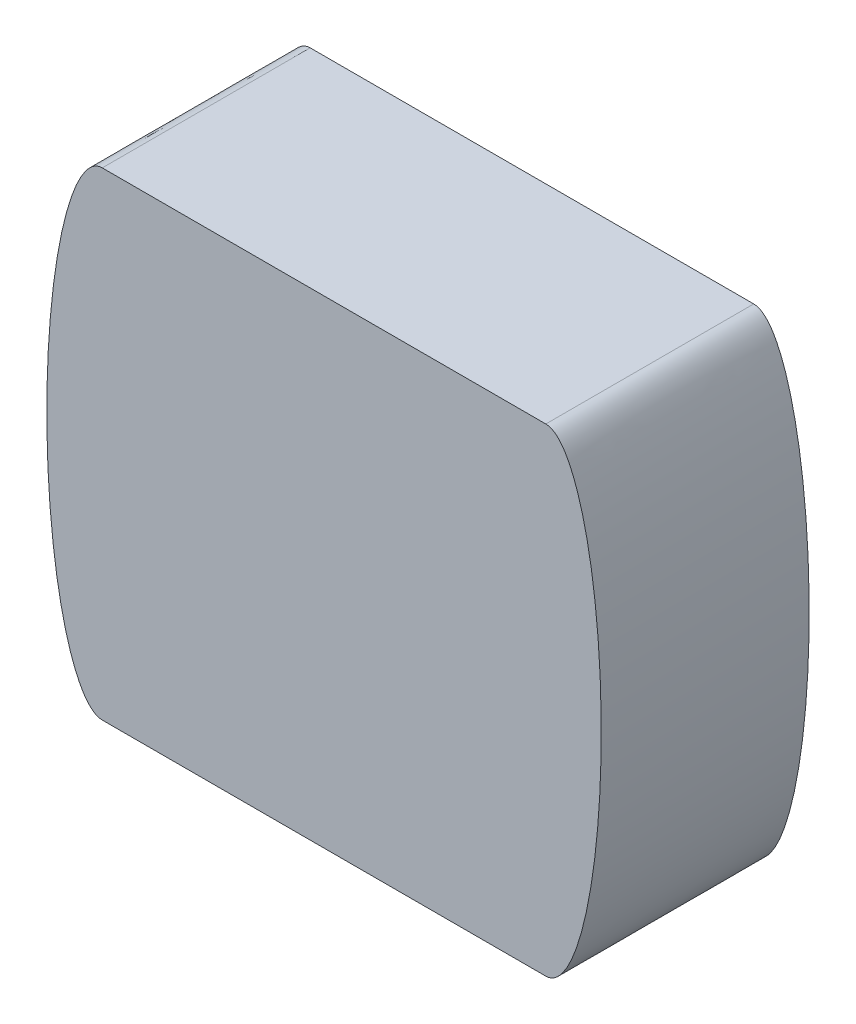
ISO-10303-21;
HEADER;
FILE_DESCRIPTION(('STEP AP214'),'2;1');
FILE_NAME('part.step','',(''),(''),'','','');
FILE_SCHEMA(('AUTOMOTIVE_DESIGN { 1 0 10303 214 1 1 1 1 }'));
ENDSEC;
DATA;
#1=APPLICATION_CONTEXT('core data for automotive mechanical design processes');
#2=APPLICATION_PROTOCOL_DEFINITION('international standard','automotive_design',2000,#1);
#3=PRODUCT_CONTEXT('',#1,'mechanical');
#4=PRODUCT('Part','Part','',(#3));
#5=PRODUCT_RELATED_PRODUCT_CATEGORY('part','',(#4));
#6=PRODUCT_DEFINITION_FORMATION('','',#4);
#7=PRODUCT_DEFINITION_CONTEXT('part definition',#1,'design');
#8=PRODUCT_DEFINITION('design','',#6,#7);
#9=PRODUCT_DEFINITION_SHAPE('','',#8);
#10=(LENGTH_UNIT() NAMED_UNIT(*) SI_UNIT(.MILLI.,.METRE.));
#11=(NAMED_UNIT(*) PLANE_ANGLE_UNIT() SI_UNIT($,.RADIAN.));
#12=(NAMED_UNIT(*) SI_UNIT($,.STERADIAN.) SOLID_ANGLE_UNIT());
#13=UNCERTAINTY_MEASURE_WITH_UNIT(LENGTH_MEASURE(1.E-05),#10,'distance_accuracy_value','');
#14=(GEOMETRIC_REPRESENTATION_CONTEXT(3) GLOBAL_UNCERTAINTY_ASSIGNED_CONTEXT((#13)) GLOBAL_UNIT_ASSIGNED_CONTEXT((#10,
#11,#12)) REPRESENTATION_CONTEXT('',''));
#15=CARTESIAN_POINT('',(0.,0.,0.));
#16=DIRECTION('',(0.,0.,1.));
#17=DIRECTION('',(1.,0.,0.));
#18=AXIS2_PLACEMENT_3D('',#15,#16,#17);
#19=CARTESIAN_POINT('',(32.264392252,-27.384502,-23.8125));
#20=DIRECTION('',(0.,0.,-1.));
#21=DIRECTION('',(-1.,0.,0.));
#22=AXIS2_PLACEMENT_3D('',#19,#20,#21);
#23=PLANE('',#22);
#24=CARTESIAN_POINT('',(-25.3999999998034,-27.384502,-23.8125));
#25=CARTESIAN_POINT('',(-25.4474108565116,-27.3845282154363,-23.8125));
#26=CARTESIAN_POINT('',(-25.4948060506385,-27.3822130377337,-23.8125));
#27=CARTESIAN_POINT('',(-25.5890954650979,-27.3731046407743,-23.8125));
#28=CARTESIAN_POINT('',(-25.63599032603,-27.3663180910956,-23.8125));
#29=CARTESIAN_POINT('',(-25.7283047487232,-27.3485950252414,-23.8125));
#30=CARTESIAN_POINT('',(-25.7737357641708,-27.3377176989436,-23.8125));
#31=CARTESIAN_POINT('',(-25.8635125307443,-27.3121405410807,-23.8125));
#32=CARTESIAN_POINT('',(-25.90785782415,-27.2974391267096,-23.8125));
#33=CARTESIAN_POINT('',(-26.0632647698725,-27.2389929897544,-23.8125));
#34=CARTESIAN_POINT('',(-26.1707857786966,-27.1856475608229,-23.8125));
#35=CARTESIAN_POINT('',(-26.3764297183469,-27.0625697469429,-23.8125));
#36=CARTESIAN_POINT('',(-26.4744896389666,-26.992736921706,-23.8125));
#37=CARTESIAN_POINT('',(-26.6514713994855,-26.849902178393,-23.8125));
#38=CARTESIAN_POINT('',(-26.731319590472,-26.7780260152477,-23.8125));
#39=CARTESIAN_POINT('',(-26.8846235541003,-26.6277007435115,-23.8125));
#40=CARTESIAN_POINT('',(-26.958073702732,-26.54924596872,-23.8125));
#41=CARTESIAN_POINT('',(-27.0994935448194,-26.3873991321746,-23.8125));
#42=CARTESIAN_POINT('',(-27.1674555546332,-26.3040004223779,-23.8125));
#43=CARTESIAN_POINT('',(-27.2985410165497,-26.133559644683,-23.8125));
#44=CARTESIAN_POINT('',(-27.3616662641783,-26.0465189475147,-23.8125));
#45=CARTESIAN_POINT('',(-27.4870927852584,-25.8647520149633,-23.8125));
#46=CARTESIAN_POINT('',(-27.5491607791176,-25.7698656560019,-23.8125));
#47=CARTESIAN_POINT('',(-27.6693071962326,-25.5775880892073,-23.8125));
#48=CARTESIAN_POINT('',(-27.7273848481928,-25.4801964020898,-23.8125));
#49=CARTESIAN_POINT('',(-27.8401408339113,-25.2832564881225,-23.8125));
#50=CARTESIAN_POINT('',(-27.8948133413012,-25.1837049378215,-23.8125));
#51=CARTESIAN_POINT('',(-28.0010713260364,-24.9829635598123,-23.8125));
#52=CARTESIAN_POINT('',(-28.0526565186571,-24.8817735820917,-23.8125));
#53=CARTESIAN_POINT('',(-28.2033876113732,-24.5760265779394,-23.8125));
#54=CARTESIAN_POINT('',(-28.2984260742924,-24.3694401971516,-23.8125));
#55=CARTESIAN_POINT('',(-28.480150254555,-23.9513072489447,-23.8125));
#56=CARTESIAN_POINT('',(-28.5667864795313,-23.7397394572367,-23.8125));
#57=CARTESIAN_POINT('',(-28.7325214830838,-23.3139834671105,-23.8125));
#58=CARTESIAN_POINT('',(-28.8116293743646,-23.0997988001774,-23.8125));
#59=CARTESIAN_POINT('',(-28.9635100293903,-22.6693134899555,-23.8125));
#60=CARTESIAN_POINT('',(-29.0362855167217,-22.4530138013187,-23.8125));
#61=CARTESIAN_POINT('',(-29.2135602433995,-21.903495852857,-23.8125));
#62=CARTESIAN_POINT('',(-29.3144169477515,-21.5691027065562,-23.8125));
#63=CARTESIAN_POINT('',(-29.5056733048012,-20.8973203985929,-23.8125));
#64=CARTESIAN_POINT('',(-29.5960714833666,-20.5599308217816,-23.8125));
#65=CARTESIAN_POINT('',(-29.7681048542818,-19.8824218059908,-23.8125));
#66=CARTESIAN_POINT('',(-29.8497273384998,-19.5422991547614,-23.8125));
#67=CARTESIAN_POINT('',(-30.0052507891167,-18.860290969483,-23.8125));
#68=CARTESIAN_POINT('',(-30.0791515076659,-18.5184053792174,-23.8125));
#69=CARTESIAN_POINT('',(-30.2202422699195,-17.8327151273564,-23.8125));
#70=CARTESIAN_POINT('',(-30.2874219375101,-17.4889083380121,-23.8125));
#71=CARTESIAN_POINT('',(-30.4156481736004,-16.8001555092042,-23.8125));
#72=CARTESIAN_POINT('',(-30.4766946760562,-16.4552094575138,-23.8125));
#73=CARTESIAN_POINT('',(-30.6515381752158,-15.4188111525561,-23.8125));
#74=CARTESIAN_POINT('',(-30.7570094471066,-14.7259459146217,-23.8125));
#75=CARTESIAN_POINT('',(-30.9491325987724,-13.3372840586145,-23.8125));
#76=CARTESIAN_POINT('',(-31.0357745752794,-12.6414860932349,-23.8125));
#77=CARTESIAN_POINT('',(-31.1923036707721,-11.248873491501,-23.8125));
#78=CARTESIAN_POINT('',(-31.2622109905159,-10.5520611128959,-23.8125));
#79=CARTESIAN_POINT('',(-31.3869337890691,-9.15750845502789,-23.8125));
#80=CARTESIAN_POINT('',(-31.4417580796198,-8.45976895785936,-23.8125));
#81=CARTESIAN_POINT('',(-31.5374525109823,-7.06340385554987,-23.8125));
#82=CARTESIAN_POINT('',(-31.5783238794439,-6.36477833379759,-23.8125));
#83=CARTESIAN_POINT('',(-31.6572886061565,-4.75457487741733,-23.8125));
#84=CARTESIAN_POINT('',(-31.6907674527856,-3.84276862746389,-23.8125));
#85=CARTESIAN_POINT('',(-31.7363018821774,-2.01832525496199,-23.8125));
#86=CARTESIAN_POINT('',(-31.7483502577537,-1.10568795612687,-23.8125));
#87=CARTESIAN_POINT('',(-31.7513344655972,0.719773327715059,-23.8125));
#88=CARTESIAN_POINT('',(-31.7422667986893,1.63259731859524,-23.8125));
#89=CARTESIAN_POINT('',(-31.7028037754042,3.45579318893192,-23.8125));
#90=CARTESIAN_POINT('',(-31.6724550774834,4.36616606720557,-23.8125));
#91=CARTESIAN_POINT('',(-31.5896117532939,6.18576080190364,-23.8125));
#92=CARTESIAN_POINT('',(-31.53712072741,7.09498282136315,-23.8125));
#93=CARTESIAN_POINT('',(-31.4083960459064,8.91162651837242,-23.8125));
#94=CARTESIAN_POINT('',(-31.3321663913154,9.81904847339608,-23.8125));
#95=CARTESIAN_POINT('',(-31.1959848430883,11.198654244039,-23.8125));
#96=CARTESIAN_POINT('',(-31.1456370801741,11.6717974995867,-23.8125));
#97=CARTESIAN_POINT('',(-31.0371687026176,12.6171989582657,-23.8125));
#98=CARTESIAN_POINT('',(-30.979048087436,13.0894571613356,-23.8125));
#99=CARTESIAN_POINT('',(-30.8543475994743,14.0328926425202,-23.8125));
#100=CARTESIAN_POINT('',(-30.787767124404,14.50406984124,-23.8125));
#101=CARTESIAN_POINT('',(-30.645266026145,15.4450095374526,-23.8125));
#102=CARTESIAN_POINT('',(-30.5693456182989,15.9147720673064,-23.8125));
#103=CARTESIAN_POINT('',(-30.4322086966101,16.7068340577818,-23.8125));
#104=CARTESIAN_POINT('',(-30.3737503971552,17.0296118982115,-23.8125));
#105=CARTESIAN_POINT('',(-30.2513439773555,17.6741238830893,-23.8125));
#106=CARTESIAN_POINT('',(-30.187395949641,17.9958580450527,-23.8125));
#107=CARTESIAN_POINT('',(-30.0533936732265,18.6381023953159,-23.8125));
#108=CARTESIAN_POINT('',(-29.9833385768171,18.958612407228,-23.8125));
#109=CARTESIAN_POINT('',(-29.8363647036672,19.5980544883913,-23.8125));
#110=CARTESIAN_POINT('',(-29.7594461387023,19.9169866060088,-23.8125));
#111=CARTESIAN_POINT('',(-29.622510781505,20.4554671980027,-23.8125));
#112=CARTESIAN_POINT('',(-29.5645334720965,20.6755347067088,-23.8125));
#113=CARTESIAN_POINT('',(-29.4443710344864,21.1145168099118,-23.8125));
#114=CARTESIAN_POINT('',(-29.382186004677,21.3334314312385,-23.8125));
#115=CARTESIAN_POINT('',(-29.2531347249479,21.7697149703282,-23.8125));
#116=CARTESIAN_POINT('',(-29.1862717537126,21.9870848553635,-23.8125));
#117=CARTESIAN_POINT('',(-29.0471806638315,22.4201012534879,-23.8125));
#118=CARTESIAN_POINT('',(-28.9749527732686,22.6357478394095,-23.8125));
#119=CARTESIAN_POINT('',(-28.8469299095056,23.0003944072859,-23.8125));
#120=CARTESIAN_POINT('',(-28.7927183200583,23.1499504361167,-23.8125));
#121=CARTESIAN_POINT('',(-28.6808996097129,23.4477857946162,-23.8125));
#122=CARTESIAN_POINT('',(-28.6232926145587,23.596065171331,-23.8125));
#123=CARTESIAN_POINT('',(-28.5041263366593,23.8913735825436,-23.8125));
#124=CARTESIAN_POINT('',(-28.4425594627229,24.0383995642403,-23.8125));
#125=CARTESIAN_POINT('',(-28.3150302320352,24.3305304280477,-23.8125));
#126=CARTESIAN_POINT('',(-28.2490681179383,24.4756354156842,-23.8125));
#127=CARTESIAN_POINT('',(-28.1073801736147,24.7732505171101,-23.8125));
#128=CARTESIAN_POINT('',(-28.0312952634311,24.9255907401118,-23.8125));
#129=CARTESIAN_POINT('',(-27.8721897512499,25.2267067925547,-23.8125));
#130=CARTESIAN_POINT('',(-27.7891666180919,25.3754812954774,-23.8125));
#131=CARTESIAN_POINT('',(-27.615035558581,25.6675830968479,-23.8125));
#132=CARTESIAN_POINT('',(-27.523955823124,25.8109270639183,-23.8125));
#133=CARTESIAN_POINT('',(-27.3315687163003,26.0905191081527,-23.8125));
#134=CARTESIAN_POINT('',(-27.2302710543238,26.2267737385979,-23.8125));
#135=CARTESIAN_POINT('',(-27.0364099826374,26.4623799656259,-23.8125));
#136=CARTESIAN_POINT('',(-26.9461864123879,26.5636426293056,-23.8125));
#137=CARTESIAN_POINT('',(-26.7554075660336,26.7567481813992,-23.8125));
#138=CARTESIAN_POINT('',(-26.6548263948228,26.8485662540644,-23.8125));
#139=CARTESIAN_POINT('',(-26.4941903954283,26.9759296140806,-23.8125));
#140=CARTESIAN_POINT('',(-26.4384870445415,27.0169682555927,-23.8125));
#141=CARTESIAN_POINT('',(-26.3238262983183,27.0943025663326,-23.8125));
#142=CARTESIAN_POINT('',(-26.2648681834248,27.1305971807389,-23.8125));
#143=CARTESIAN_POINT('',(-26.1441126556514,27.1970880726625,-23.8125));
#144=CARTESIAN_POINT('',(-26.0823381371202,27.2273254587272,-23.8125));
#145=CARTESIAN_POINT('',(-25.9558581984847,27.2807556575759,-23.8125));
#146=CARTESIAN_POINT('',(-25.891155883347,27.3039557412197,-23.8125));
#147=CARTESIAN_POINT('',(-25.756536559696,27.3429091687682,-23.8125));
#148=CARTESIAN_POINT('',(-25.6865146275223,27.358310700453,-23.8125));
#149=CARTESIAN_POINT('',(-25.5800873672771,27.3739225437953,-23.8125));
#150=CARTESIAN_POINT('',(-25.5442035148857,27.377878741608,-23.8125));
#151=CARTESIAN_POINT('',(-25.4722177793299,27.3831722970032,-23.8125));
#152=CARTESIAN_POINT('',(-25.4361157579886,27.3845077701716,-23.8125));
#153=CARTESIAN_POINT('',(-25.4000000007193,27.384502,-23.8125));
#154=B_SPLINE_CURVE_WITH_KNOTS('',3,(#24,#25,#26,#27,#28,#29,#30,#31,#32,#33,#34,#35,#36,#37,
#38,#39,#40,#41,#42,#43,#44,#45,#46,#47,#48,#49,#50,#51,#52,#53,#54,#55,#56,#57,#58,#59,#60,#61,
#62,#63,#64,#65,#66,#67,#68,#69,#70,#71,#72,#73,#74,#75,#76,#77,#78,#79,#80,#81,#82,#83,#84,#85,
#86,#87,#88,#89,#90,#91,#92,#93,#94,#95,#96,#97,#98,#99,#100,#101,#102,#103,#104,#105,#106,#107,
#108,#109,#110,#111,#112,#113,#114,#115,#116,#117,#118,#119,#120,#121,#122,#123,#124,#125,#126,
#127,#128,#129,#130,#131,#132,#133,#134,#135,#136,#137,#138,#139,#140,#141,#142,#143,#144,#145,
#146,#147,#148,#149,#150,#151,#152,#153),.UNSPECIFIED.,.F.,.F.,(4,2,2,2,2,2,2,2,2,2,2,2,2,2,2,2,
2,2,2,2,2,2,2,2,2,2,2,2,2,2,2,2,2,2,2,2,2,2,2,2,2,2,2,2,2,2,2,2,2,2,2,2,2,2,2,2,2,2,2,2,2,2,2,2,
4),(0.,0.142150840148898,0.284090124156124,0.424050102074764,0.564068102447389,
0.921925257352111,1.28202142386815,1.60384354387866,1.92594575600812,2.24849137728689,
2.57091667563069,2.91095074569661,3.25105035732693,3.59171675538916,3.93241452281851,
4.61431756957029,5.30002019401909,5.984881958311,6.6694476902224,7.71703647860022,
8.76477274549915,9.81400637010674,10.8632736621961,11.9141366193606,12.9650108913293,
15.0672096157166,17.1705113299753,19.2712611546976,21.3707810697089,23.4701162105441,
26.2071040607239,28.9450122012183,31.6833740773829,34.4157508176512,37.147683439389,
39.8791558563502,41.3065471960198,42.733938634716,44.1614317519346,45.5888919628844,
46.5729380475207,47.5569675312397,48.5411338241977,49.5252697607052,50.207964212044,
50.8906427049485,51.5728474236995,52.2550231559485,52.7322233186607,53.2094058200393,
53.6875320542297,54.1656319136472,54.6763382710402,55.187231761424,55.6964034073216,
56.2050957006323,56.6114947803578,57.0189357746915,57.2263113325813,57.433732921713,
57.6396951881414,57.8454439261606,58.0597930136998,58.1680118699525,58.2763085117668),.UNSPECIFIED.);
#155=CARTESIAN_POINT('',(-25.4000000004151,-27.384502,-23.8125));
#156=VERTEX_POINT('',#155);
#157=CARTESIAN_POINT('',(-25.4000000023452,27.384502,-23.8125));
#158=VERTEX_POINT('',#157);
#159=EDGE_CURVE('E81',#156,#158,#154,.T.);
#160=ORIENTED_EDGE('',*,*,#159,.T.);
#161=DIRECTION('',(-1.,0.,0.));
#162=VECTOR('',#161,1.);
#163=CARTESIAN_POINT('',(0.,27.384502,-23.8125));
#164=LINE('',#163,#162);
#165=CARTESIAN_POINT('',(25.3999999988274,27.384502,-23.8125));
#166=VERTEX_POINT('',#165);
#167=EDGE_CURVE('E62',#166,#158,#164,.T.);
#168=ORIENTED_EDGE('',*,*,#167,.F.);
#169=CARTESIAN_POINT('',(25.3999999983741,27.384502,-23.8125));
#170=CARTESIAN_POINT('',(25.4474108551471,27.3845282154825,-23.8125));
#171=CARTESIAN_POINT('',(25.4948060493412,27.3822130378194,-23.8125));
#172=CARTESIAN_POINT('',(25.5890954639371,27.3731046409255,-23.8125));
#173=CARTESIAN_POINT('',(25.6359903249385,27.3663180912728,-23.8125));
#174=CARTESIAN_POINT('',(25.7283047477676,27.3485950254568,-23.8125));
#175=CARTESIAN_POINT('',(25.7737357632818,27.3377176991717,-23.8125));
#176=CARTESIAN_POINT('',(25.8635125299872,27.3121405413217,-23.8125));
#177=CARTESIAN_POINT('',(25.9078578234583,27.2974391269509,-23.8125));
#178=CARTESIAN_POINT('',(26.0632647692406,27.2389929900402,-23.8125));
#179=CARTESIAN_POINT('',(26.1707857780645,27.1856475611562,-23.8125));
#180=CARTESIAN_POINT('',(26.376429717718,27.0625697473649,-23.8125));
#181=CARTESIAN_POINT('',(26.4744896383412,26.9927369221692,-23.8125));
#182=CARTESIAN_POINT('',(26.6514713988254,26.8499021789628,-23.8125));
#183=CARTESIAN_POINT('',(26.7313195897775,26.7780260158879,-23.8125));
#184=CARTESIAN_POINT('',(26.8846235533428,26.6277007442951,-23.8125));
#185=CARTESIAN_POINT('',(26.9580737019459,26.5492459695763,-23.8125));
#186=CARTESIAN_POINT('',(27.0994935439804,26.387399133178,-23.8125));
#187=CARTESIAN_POINT('',(27.1674555537698,26.3040004234556,-23.8125));
#188=CARTESIAN_POINT('',(27.298541015641,26.1335596459096,-23.8125));
#189=CARTESIAN_POINT('',(27.3616662632485,26.046518948816,-23.8125));
#190=CARTESIAN_POINT('',(27.4870927842682,25.8647520164471,-23.8125));
#191=CARTESIAN_POINT('',(27.5491607780896,25.7698656575944,-23.8125));
#192=CARTESIAN_POINT('',(27.6693071951336,25.5775880910189,-23.8125));
#193=CARTESIAN_POINT('',(27.7273848470604,25.4801964040116,-23.8125));
#194=CARTESIAN_POINT('',(27.8401408327161,25.2832564902661,-23.8125));
#195=CARTESIAN_POINT('',(27.8948133400763,25.1837049400766,-23.8125));
#196=CARTESIAN_POINT('',(28.0010713247555,24.982963562291,-23.8125));
#197=CARTESIAN_POINT('',(28.0526565173497,24.8817735846825,-23.8125));
#198=CARTESIAN_POINT('',(28.2033876099902,24.5760265808677,-23.8125));
#199=CARTESIAN_POINT('',(28.2984260728642,24.3694402003059,-23.8125));
#200=CARTESIAN_POINT('',(28.4801502530442,23.9513072525531,-23.8125));
#201=CARTESIAN_POINT('',(28.5667864779832,23.7397394610733,-23.8125));
#202=CARTESIAN_POINT('',(28.7325214814673,23.3139834714035,-23.8125));
#203=CARTESIAN_POINT('',(28.8116293727171,23.0997988046987,-23.8125));
#204=CARTESIAN_POINT('',(28.9635100276861,22.6693134949337,-23.8125));
#205=CARTESIAN_POINT('',(29.0362855149918,22.4530138065255,-23.8125));
#206=CARTESIAN_POINT('',(29.2135602415892,21.9034958587073,-23.8125));
#207=CARTESIAN_POINT('',(29.3144169458919,21.5691027128224,-23.8125));
#208=CARTESIAN_POINT('',(29.5056733028554,20.8973204056922,-23.8125));
#209=CARTESIAN_POINT('',(29.5960714813839,20.559930829298,-23.8125));
#210=CARTESIAN_POINT('',(29.7681048522354,19.8824218143426,-23.8125));
#211=CARTESIAN_POINT('',(29.8497273364266,19.5422991635316,-23.8125));
#212=CARTESIAN_POINT('',(30.005250786999,18.8602909790904,-23.8125));
#213=CARTESIAN_POINT('',(30.0791515055305,18.5184053892436,-23.8125));
#214=CARTESIAN_POINT('',(30.2202422677564,17.8327151382209,-23.8125));
#215=CARTESIAN_POINT('',(30.2874219353373,17.4889083492963,-23.8125));
#216=CARTESIAN_POINT('',(30.4156481714153,16.8001555213276,-23.8125));
#217=CARTESIAN_POINT('',(30.4766946738687,16.4552094700569,-23.8125));
#218=CARTESIAN_POINT('',(30.6515381730309,15.4188111663584,-23.8125));
#219=CARTESIAN_POINT('',(30.7570094449371,14.7259459292635,-23.8125));
#220=CARTESIAN_POINT('',(30.9491325966583,13.3372840749336,-23.8125));
#221=CARTESIAN_POINT('',(31.0357745732052,12.6414861103917,-23.8125));
#222=CARTESIAN_POINT('',(31.1923036688011,11.2488735103313,-23.8125));
#223=CARTESIAN_POINT('',(31.2622109886079,10.5520611325621,-23.8125));
#224=CARTESIAN_POINT('',(31.3869337873098,9.15750847636415,-23.8125));
#225=CARTESIAN_POINT('',(31.4417580779461,8.4597689800298,-23.8125));
#226=CARTESIAN_POINT('',(31.5374525095029,7.06340387938712,-23.8125));
#227=CARTESIAN_POINT('',(31.578323878073,6.36477835846748,-23.8125));
#228=CARTESIAN_POINT('',(31.6572886051482,4.75457490226504,-23.8125));
#229=CARTESIAN_POINT('',(31.6907674519969,3.84276865165398,-23.8125));
#230=CARTESIAN_POINT('',(31.7363018817916,2.01832527783092,-23.8125));
#231=CARTESIAN_POINT('',(31.748350257551,1.10568797833225,-23.8125));
#232=CARTESIAN_POINT('',(31.7513344657296,-0.719773306840948,-23.8125));
#233=CARTESIAN_POINT('',(31.7422667989738,-1.63259729838885,-23.8125));
#234=CARTESIAN_POINT('',(31.7028037759653,-3.45579317006146,-23.8125));
#235=CARTESIAN_POINT('',(31.6724550781692,-4.36616604900331,-23.8125));
#236=CARTESIAN_POINT('',(31.5896117542046,-6.18576078503978,-23.8125));
#237=CARTESIAN_POINT('',(31.537120728421,-7.09498280516951,-23.8125));
#238=CARTESIAN_POINT('',(31.4083960470953,-8.911626503521,-23.8125));
#239=CARTESIAN_POINT('',(31.3321663925819,-9.81904845921668,-23.8125));
#240=CARTESIAN_POINT('',(31.1959848444576,-11.1986542308707,-23.8125));
#241=CARTESIAN_POINT('',(31.1456370815767,-11.6717974867568,-23.8125));
#242=CARTESIAN_POINT('',(31.0371687040814,-12.6171989461132,-23.8125));
#243=CARTESIAN_POINT('',(30.9790480889276,-13.0894571495221,-23.8125));
#244=CARTESIAN_POINT('',(30.854347601016,-14.0328926313851,-23.8125));
#245=CARTESIAN_POINT('',(30.787767125968,-14.5040698304445,-23.8125));
#246=CARTESIAN_POINT('',(30.645266027748,-15.4450095273367,-23.8125));
#247=CARTESIAN_POINT('',(30.5693456199186,-15.9147720575306,-23.8125));
#248=CARTESIAN_POINT('',(30.4322086982542,-16.7068340485758,-23.8125));
#249=CARTESIAN_POINT('',(30.3737503988085,-17.029611889235,-23.8125));
#250=CARTESIAN_POINT('',(30.2513439790247,-17.6741238745723,-23.8125));
#251=CARTESIAN_POINT('',(30.1873959513167,-17.9958580367657,-23.8125));
#252=CARTESIAN_POINT('',(30.0533936749129,-18.6381023874891,-23.8125));
#253=CARTESIAN_POINT('',(29.9833385785075,-18.9586123996316,-23.8125));
#254=CARTESIAN_POINT('',(29.8363647053628,-19.598054481256,-23.8125));
#255=CARTESIAN_POINT('',(29.7594461403994,-19.9169865991044,-23.8125));
#256=CARTESIAN_POINT('',(29.6225107832023,-20.4554671914886,-23.8125));
#257=CARTESIAN_POINT('',(29.5645334737934,-20.6755347003539,-23.8125));
#258=CARTESIAN_POINT('',(29.4443710361813,-21.1145168038757,-23.8125));
#259=CARTESIAN_POINT('',(29.3821860063702,-21.3334314253621,-23.8125));
#260=CARTESIAN_POINT('',(29.2531347266364,-21.7697149647718,-23.8125));
#261=CARTESIAN_POINT('',(29.186271755398,-21.9870848499676,-23.8125));
#262=CARTESIAN_POINT('',(29.0471806655094,-22.4201012484134,-23.8125));
#263=CARTESIAN_POINT('',(28.974952774942,-22.6357478344962,-23.8125));
#264=CARTESIAN_POINT('',(28.8469299111701,-23.0003944026475,-23.8125));
#265=CARTESIAN_POINT('',(28.7927183217188,-23.1499504315919,-23.8125));
#266=CARTESIAN_POINT('',(28.6808996113646,-23.4477857903191,-23.8125));
#267=CARTESIAN_POINT('',(28.6232926162055,-23.5960651671482,-23.8125));
#268=CARTESIAN_POINT('',(28.504126338296,-23.8913735785896,-23.8125));
#269=CARTESIAN_POINT('',(28.4425594643543,-24.038399560401,-23.8125));
#270=CARTESIAN_POINT('',(28.3150302336553,-24.3305304244387,-23.8125));
#271=CARTESIAN_POINT('',(28.2490681195524,-24.4756354121908,-23.8125));
#272=CARTESIAN_POINT('',(28.1073801752287,-24.7732505138298,-23.8125));
#273=CARTESIAN_POINT('',(28.0312952650521,-24.9255907369295,-23.8125));
#274=CARTESIAN_POINT('',(27.8721897528865,-25.226706789572,-23.8125));
#275=CARTESIAN_POINT('',(27.7891666197373,-25.3754812925963,-23.8125));
#276=CARTESIAN_POINT('',(27.615035560246,-25.6675830941757,-23.8125));
#277=CARTESIAN_POINT('',(27.5239558247999,-25.8109270613534,-23.8125));
#278=CARTESIAN_POINT('',(27.3315687180009,-26.0905191058111,-23.8125));
#279=CARTESIAN_POINT('',(27.2302710560381,-26.2267737363722,-23.8125));
#280=CARTESIAN_POINT('',(27.0364099843548,-26.4623799636521,-23.8125));
#281=CARTESIAN_POINT('',(26.9461864140915,-26.5636426274629,-23.8125));
#282=CARTESIAN_POINT('',(26.755407567704,-26.7567481798272,-23.8125));
#283=CARTESIAN_POINT('',(26.6548263964737,-26.8485662526318,-23.8125));
#284=CARTESIAN_POINT('',(26.4941903970417,-26.975929612864,-23.8125));
#285=CARTESIAN_POINT('',(26.4384870461412,-27.0169682544498,-23.8125));
#286=CARTESIAN_POINT('',(26.3238262998864,-27.094302565339,-23.8125));
#287=CARTESIAN_POINT('',(26.264868184975,-27.1305971798208,-23.8125));
#288=CARTESIAN_POINT('',(26.1441126571613,-27.1970880718951,-23.8125));
#289=CARTESIAN_POINT('',(26.0823381386076,-27.2273254580352,-23.8125));
#290=CARTESIAN_POINT('',(25.9558581999199,-27.2807556570333,-23.8125));
#291=CARTESIAN_POINT('',(25.8911558847522,-27.3039557407514,-23.8124999999999));
#292=CARTESIAN_POINT('',(25.7565365606685,-27.3429091685509,-23.8125000000001));
#293=CARTESIAN_POINT('',(25.6865146280774,-27.3583107003653,-23.8125000000003));
#294=CARTESIAN_POINT('',(25.5800873671867,-27.3739225438117,-23.8124999999999));
#295=CARTESIAN_POINT('',(25.5442035145735,-27.3778787416439,-23.8124999999996));
#296=CARTESIAN_POINT('',(25.4722177785724,-27.3831722970459,-23.8125000000004));
#297=CARTESIAN_POINT('',(25.4361157570073,-27.3845077702013,-23.8125000000014));
#298=CARTESIAN_POINT('',(25.3999999995153,-27.384502,-23.8125000000037));
#299=B_SPLINE_CURVE_WITH_KNOTS('',3,(#169,#170,#171,#172,#173,#174,#175,#176,#177,#178,#179,
#180,#181,#182,#183,#184,#185,#186,#187,#188,#189,#190,#191,#192,#193,#194,#195,#196,#197,#198,
#199,#200,#201,#202,#203,#204,#205,#206,#207,#208,#209,#210,#211,#212,#213,#214,#215,#216,#217,
#218,#219,#220,#221,#222,#223,#224,#225,#226,#227,#228,#229,#230,#231,#232,#233,#234,#235,#236,
#237,#238,#239,#240,#241,#242,#243,#244,#245,#246,#247,#248,#249,#250,#251,#252,#253,#254,#255,
#256,#257,#258,#259,#260,#261,#262,#263,#264,#265,#266,#267,#268,#269,#270,#271,#272,#273,#274,
#275,#276,#277,#278,#279,#280,#281,#282,#283,#284,#285,#286,#287,#288,#289,#290,#291,#292,#293,
#294,#295,#296,#297,#298),.UNSPECIFIED.,.F.,.F.,(4,2,2,2,2,2,2,2,2,2,2,2,2,2,2,2,2,2,2,2,2,2,2,
2,2,2,2,2,2,2,2,2,2,2,2,2,2,2,2,2,2,2,2,2,2,2,2,2,2,2,2,2,2,2,2,2,2,2,2,2,2,2,2,2,4),(0.,
0.142150840343272,0.284090124544131,0.424050102647561,0.56406810320504,0.921925258045287,
1.28202142449715,1.60384354429005,1.92594575620147,2.24849137726156,2.5709166753869,
2.91095074511779,3.25105035641297,3.59171675413937,3.93241452123286,4.61431756731227,
5.30002019108531,5.98488195470249,6.66944768593954,7.71703647308032,8.76477273874202,
9.81400636211048,10.8632736529607,11.9141366088842,12.9650108796119,15.0672096015166,
17.1705113132966,19.2712611355431,21.3707810480799,23.4701161864408,26.2071040386153,
28.9450121811069,31.6833740592695,34.4157508015284,37.1476834252558,39.8791558442062,
41.3065471848748,42.7339386245701,44.1614317427878,45.5888919547367,46.5729380400457,
47.5569675244374,48.5411338180678,49.5252697552477,50.2079642070487,50.8906427004153,
51.5728474196289,52.2550231523405,52.7322233153772,53.2094058170804,53.6875320515942,
54.1656319113352,54.6763382689821,55.1872317596195,55.6964034057718,56.2050956993383,
56.6114947793857,57.0189357740455,57.2263113321,57.4337329213962,57.6396951879841,
57.8454439261633,58.0597930149955,58.1680118719142,58.276308514396),.UNSPECIFIED.);
#300=CARTESIAN_POINT('',(25.3999999997734,-27.384502,-23.8125));
#301=VERTEX_POINT('',#300);
#302=EDGE_CURVE('E22',#166,#301,#299,.T.);
#303=ORIENTED_EDGE('',*,*,#302,.T.);
#304=DIRECTION('',(1.,0.,0.));
#305=VECTOR('',#304,1.);
#306=CARTESIAN_POINT('',(0.,-27.384502,-23.8125));
#307=LINE('',#306,#305);
#308=EDGE_CURVE('E66',#156,#301,#307,.T.);
#309=ORIENTED_EDGE('',*,*,#308,.F.);
#310=EDGE_LOOP('',(#160,#168,#303,#309));
#311=FACE_BOUND('',#310,.T.);
#312=ADVANCED_FACE('F17',(#311),#23,.T.);
#313=CARTESIAN_POINT('',(-25.4,27.384502,-23.8125));
#314=DIRECTION('',(0.,1.,0.));
#315=DIRECTION('',(0.,0.,1.));
#316=AXIS2_PLACEMENT_3D('',#313,#314,#315);
#317=PLANE('',#316);
#318=DIRECTION('',(1.,0.,0.));
#319=VECTOR('',#318,1.);
#320=CARTESIAN_POINT('',(0.,27.384502,0.));
#321=LINE('',#320,#319);
#322=CARTESIAN_POINT('',(-25.400000000266,27.384502,0.));
#323=VERTEX_POINT('',#322);
#324=CARTESIAN_POINT('',(25.3999999977878,27.384502,0.));
#325=VERTEX_POINT('',#324);
#326=EDGE_CURVE('E130',#323,#325,#321,.T.);
#327=ORIENTED_EDGE('',*,*,#326,.T.);
#328=DIRECTION('',(0.,0.,-1.));
#329=VECTOR('',#328,1.);
#330=CARTESIAN_POINT('',(25.3999999976548,27.384502,-11.90625));
#331=LINE('',#330,#329);
#332=EDGE_CURVE('E75',#325,#166,#331,.T.);
#333=ORIENTED_EDGE('',*,*,#332,.T.);
#334=ORIENTED_EDGE('',*,*,#167,.T.);
#335=DIRECTION('',(0.,0.,1.));
#336=VECTOR('',#335,1.);
#337=CARTESIAN_POINT('',(-25.4000000023452,27.384502,-11.90625));
#338=LINE('',#337,#336);
#339=EDGE_CURVE('E111',#158,#323,#338,.T.);
#340=ORIENTED_EDGE('',*,*,#339,.T.);
#341=EDGE_LOOP('',(#327,#333,#334,#340));
#342=FACE_BOUND('',#341,.T.);
#343=ADVANCED_FACE('F115',(#342),#317,.T.);
#344=CARTESIAN_POINT('',(25.4,-27.384502,0.));
#345=CARTESIAN_POINT('',(25.4,-27.384502,-23.8125));
#346=CARTESIAN_POINT('',(29.119743879,-27.384502,0.));
#347=CARTESIAN_POINT('',(29.119743879,-27.384502,-23.8125));
#348=CARTESIAN_POINT('',(31.75,-16.041469873,0.));
#349=CARTESIAN_POINT('',(31.75,-16.041469873,-23.8125));
#350=CARTESIAN_POINT('',(31.75,0.,0.));
#351=CARTESIAN_POINT('',(31.75,0.,-23.8125));
#352=CARTESIAN_POINT('',(31.75,16.041469873,0.));
#353=CARTESIAN_POINT('',(31.75,16.041469873,-23.8125));
#354=CARTESIAN_POINT('',(29.119743879,27.384502,0.));
#355=CARTESIAN_POINT('',(29.119743879,27.384502,-23.8125));
#356=CARTESIAN_POINT('',(25.4,27.384502,0.));
#357=CARTESIAN_POINT('',(25.4,27.384502,-23.8125));
#358=CARTESIAN_POINT('',(25.3998,27.384502,0.));
#359=CARTESIAN_POINT('',(25.3998,27.384502,-23.8125));
#360=CARTESIAN_POINT('',(25.3996,27.384502,0.));
#361=CARTESIAN_POINT('',(25.3996,27.384502,-23.8125));
#362=CARTESIAN_POINT('',(25.3994,27.384502,0.));
#363=CARTESIAN_POINT('',(25.3994,27.384502,-23.8125));
#364=(BOUNDED_SURFACE() B_SPLINE_SURFACE(3,1,((#344,#345),(#346,#347),(#348,#349),(#350,#351),
(#352,#353),(#354,#355),(#356,#357),(#358,#359),(#360,#361),(#362,#363)),.UNSPECIFIED.,.F.,.F.,
.F.) B_SPLINE_SURFACE_WITH_KNOTS((4,3,3,4),(2,2),(0.,1.5707963267949,3.14159265358979,
3.14169760358045),(0.,1.),
.UNSPECIFIED.) GEOMETRIC_REPRESENTATION_ITEM() RATIONAL_B_SPLINE_SURFACE(((1.,1.),
(0.804737854124365,0.804737854124365),(0.804737854124365,0.804737854124365),(1.,1.),
(0.804737854124365,0.804737854124365),(0.804737854124365,0.804737854124365),(1.,1.),(1.,1.),(1.,
1.),(1.,1.))) REPRESENTATION_ITEM('') SURFACE());
#365=DIRECTION('',(0.,0.,1.));
#366=VECTOR('',#365,1.);
#367=CARTESIAN_POINT('',(25.4,-27.384502,-11.90625));
#368=LINE('',#367,#366);
#369=CARTESIAN_POINT('',(25.3999999990934,-27.384502,0.));
#370=VERTEX_POINT('',#369);
#371=EDGE_CURVE('E70',#301,#370,#368,.T.);
#372=CARTESIAN_POINT('',(25.3999999979209,27.384502,0.));
#373=CARTESIAN_POINT('',(25.4474108547151,27.3845282154972,0.));
#374=CARTESIAN_POINT('',(25.494806048931,27.3822130378466,0.));
#375=CARTESIAN_POINT('',(25.5890954635714,27.3731046409732,0.));
#376=CARTESIAN_POINT('',(25.6359903245954,27.3663180913285,0.));
#377=CARTESIAN_POINT('',(25.7283047474687,27.3485950255242,0.));
#378=CARTESIAN_POINT('',(25.7737357630046,27.3377176992428,0.));
#379=CARTESIAN_POINT('',(25.8635125297529,27.3121405413963,0.));
#380=CARTESIAN_POINT('',(25.9078578232451,27.2974391270252,0.));
#381=CARTESIAN_POINT('',(26.0632647690476,27.2389929901275,0.));
#382=CARTESIAN_POINT('',(26.1707857778721,27.1856475612577,0.));
#383=CARTESIAN_POINT('',(26.3764297175276,27.0625697474927,0.));
#384=CARTESIAN_POINT('',(26.4744896381523,26.9927369223091,0.));
#385=CARTESIAN_POINT('',(26.6514713986266,26.8499021791344,0.));
#386=CARTESIAN_POINT('',(26.7313195895683,26.7780260160808,0.));
#387=CARTESIAN_POINT('',(26.8846235531146,26.6277007445312,0.));
#388=CARTESIAN_POINT('',(26.9580737017091,26.5492459698344,0.));
#389=CARTESIAN_POINT('',(27.0994935437275,26.3873991334804,0.));
#390=CARTESIAN_POINT('',(27.1674555535095,26.3040004237804,0.));
#391=CARTESIAN_POINT('',(27.298541015367,26.1335596462793,0.));
#392=CARTESIAN_POINT('',(27.3616662629682,26.0465189492082,0.));
#393=CARTESIAN_POINT('',(27.4870927839697,25.8647520168943,0.));
#394=CARTESIAN_POINT('',(27.5491607777797,25.7698656580745,0.));
#395=CARTESIAN_POINT('',(27.6693071948022,25.577588091565,0.));
#396=CARTESIAN_POINT('',(27.7273848467191,25.480196404591,0.));
#397=CARTESIAN_POINT('',(27.8401408323558,25.2832564909123,0.));
#398=CARTESIAN_POINT('',(27.8948133397071,25.1837049407564,0.));
#399=CARTESIAN_POINT('',(28.0010713243693,24.9829635630382,0.));
#400=CARTESIAN_POINT('',(28.0526565169556,24.8817735854636,0.));
#401=CARTESIAN_POINT('',(28.2033876095732,24.5760265817504,0.));
#402=CARTESIAN_POINT('',(28.2984260724337,24.3694402012568,0.));
#403=CARTESIAN_POINT('',(28.4801502525888,23.9513072536409,0.));
#404=CARTESIAN_POINT('',(28.5667864775165,23.7397394622298,0.));
#405=CARTESIAN_POINT('',(28.73252148098,23.3139834726976,0.));
#406=CARTESIAN_POINT('',(28.8116293722204,23.0997988060617,0.));
#407=CARTESIAN_POINT('',(28.9635100271724,22.6693134964344,0.));
#408=CARTESIAN_POINT('',(29.0362855144703,22.453013808095,0.));
#409=CARTESIAN_POINT('',(29.2135602410435,21.9034958604708,0.));
#410=CARTESIAN_POINT('',(29.3144169453314,21.5691027147113,0.));
#411=CARTESIAN_POINT('',(29.5056733022689,20.8973204078322,0.));
#412=CARTESIAN_POINT('',(29.5960714807862,20.5599308315637,0.));
#413=CARTESIAN_POINT('',(29.7681048516185,19.8824218168602,0.));
#414=CARTESIAN_POINT('',(29.8497273358017,19.5422991661753,0.));
#415=CARTESIAN_POINT('',(30.0052507863607,18.8602909819865,0.));
#416=CARTESIAN_POINT('',(30.0791515048868,18.5184053922659,0.));
#417=CARTESIAN_POINT('',(30.2202422671044,17.8327151414959,0.));
#418=CARTESIAN_POINT('',(30.2874219346823,17.4889083526978,0.));
#419=CARTESIAN_POINT('',(30.4156481707566,16.8001555249821,0.));
#420=CARTESIAN_POINT('',(30.4766946732092,16.4552094738379,0.));
#421=CARTESIAN_POINT('',(30.6515381723723,15.418811170519,0.));
#422=CARTESIAN_POINT('',(30.7570094442831,14.7259459336771,0.));
#423=CARTESIAN_POINT('',(30.949132596021,13.3372840798528,0.));
#424=CARTESIAN_POINT('',(31.03577457258,12.6414861155635,0.));
#425=CARTESIAN_POINT('',(31.1923036682069,11.2488735160076,0.));
#426=CARTESIAN_POINT('',(31.2622109880328,10.5520611384904,0.));
#427=CARTESIAN_POINT('',(31.3869337867795,9.15750848279587,0.));
#428=CARTESIAN_POINT('',(31.4417580774417,8.45976898671297,0.));
#429=CARTESIAN_POINT('',(31.5374525090569,7.06340388657275,0.));
#430=CARTESIAN_POINT('',(31.5783238776597,6.36477836590412,0.));
#431=CARTESIAN_POINT('',(31.6572886048442,4.75457490975542,0.));
#432=CARTESIAN_POINT('',(31.6907674517592,3.84276865894628,0.));
#433=CARTESIAN_POINT('',(31.7363018816752,2.01832528472524,0.));
#434=CARTESIAN_POINT('',(31.7483502574898,1.10568798502669,0.));
#435=CARTESIAN_POINT('',(31.7513344657695,-0.719773300547531,0.));
#436=CARTESIAN_POINT('',(31.7422667990595,-1.63259729229657,0.));
#437=CARTESIAN_POINT('',(31.7028037761344,-3.45579316437161,0.));
#438=CARTESIAN_POINT('',(31.6724550783759,-4.36616604351476,0.));
#439=CARTESIAN_POINT('',(31.5896117544792,-6.18576077995443,0.));
#440=CARTESIAN_POINT('',(31.5371207287259,-7.09498280028606,0.));
#441=CARTESIAN_POINT('',(31.4083960474539,-8.91162649904189,0.));
#442=CARTESIAN_POINT('',(31.3321663929639,-9.81904845494002,0.));
#443=CARTESIAN_POINT('',(31.1959848448699,-11.1986542269059,0.));
#444=CARTESIAN_POINT('',(31.1456370819982,-11.6717974829013,0.));
#445=CARTESIAN_POINT('',(31.0371687045195,-12.6171989424763,0.));
#446=CARTESIAN_POINT('',(30.979048089373,-13.0894571459946,0.));
#447=CARTESIAN_POINT('',(30.8543476014741,-14.0328926280765,0.));
#448=CARTESIAN_POINT('',(30.7877671264315,-14.5040698272453,0.));
#449=CARTESIAN_POINT('',(30.6452660282203,-15.4450095243566,0.));
#450=CARTESIAN_POINT('',(30.5693456203943,-15.9147720546601,0.));
#451=CARTESIAN_POINT('',(30.4322086987338,-16.7068340458907,0.));
#452=CARTESIAN_POINT('',(30.3737503992892,-17.0296118866255,0.));
#453=CARTESIAN_POINT('',(30.2513439795065,-17.6741238721142,0.));
#454=CARTESIAN_POINT('',(30.1873959517985,-17.9958580343833,0.));
#455=CARTESIAN_POINT('',(30.0533936753936,-18.6381023852582,0.));
#456=CARTESIAN_POINT('',(29.9833385789871,-18.9586123974765,0.));
#457=CARTESIAN_POINT('',(29.8363647058391,-19.5980544792525,0.));
#458=CARTESIAN_POINT('',(29.7594461408733,-19.9169865971768,0.));
#459=CARTESIAN_POINT('',(29.6225107836711,-20.4554671896895,0.));
#460=CARTESIAN_POINT('',(29.5645334742599,-20.6755346986074,0.));
#461=CARTESIAN_POINT('',(29.4443710366422,-21.1145168022345,0.));
#462=CARTESIAN_POINT('',(29.382186006828,-21.3334314237736,0.));
#463=CARTESIAN_POINT('',(29.2531347270872,-21.7697149632887,0.));
#464=CARTESIAN_POINT('',(29.1862717558449,-21.9870848485372,0.));
#465=CARTESIAN_POINT('',(29.0471806659476,-22.4201012470885,0.));
#466=CARTESIAN_POINT('',(28.9749527753754,-22.635747833224,0.));
#467=CARTESIAN_POINT('',(28.8469299115944,-23.0003944014652,0.));
#468=CARTESIAN_POINT('',(28.7927183221391,-23.1499504304467,0.));
#469=CARTESIAN_POINT('',(28.6808996117763,-23.4477857892482,0.));
#470=CARTESIAN_POINT('',(28.6232926166127,-23.5960651661143,0.));
#471=CARTESIAN_POINT('',(28.5041263386934,-23.8913735776299,0.));
#472=CARTESIAN_POINT('',(28.4425594647465,-24.0383995594783,0.));
#473=CARTESIAN_POINT('',(28.3150302340363,-24.3305304235902,0.));
#474=CARTESIAN_POINT('',(28.2490681199274,-24.4756354113795,0.));
#475=CARTESIAN_POINT('',(28.1073801755949,-24.7732505130859,0.));
#476=CARTESIAN_POINT('',(28.0312952654157,-24.925590736216,0.));
#477=CARTESIAN_POINT('',(27.8721897532445,-25.2267067889199,0.));
#478=CARTESIAN_POINT('',(27.7891666200923,-25.3754812919751,0.));
#479=CARTESIAN_POINT('',(27.6150355605944,-25.6675830936168,0.));
#480=CARTESIAN_POINT('',(27.5239558251448,-25.8109270608259,0.));
#481=CARTESIAN_POINT('',(27.331568718338,-26.0905191053474,0.));
#482=CARTESIAN_POINT('',(27.230271056371,-26.2267737359407,0.));
#483=CARTESIAN_POINT('',(27.036409984667,-26.4623799632941,0.));
#484=CARTESIAN_POINT('',(26.9461864143864,-26.5636426271451,0.));
#485=CARTESIAN_POINT('',(26.7554075679596,-26.7567481795879,0.));
#486=CARTESIAN_POINT('',(26.6548263967073,-26.8485662524308,0.));
#487=CARTESIAN_POINT('',(26.4941903972368,-26.9759296127174,0.));
#488=CARTESIAN_POINT('',(26.4384870463221,-27.0169682543211,0.));
#489=CARTESIAN_POINT('',(26.3238263000368,-27.0943025652442,0.));
#490=CARTESIAN_POINT('',(26.2648681851093,-27.1305971797419,0.));
#491=CARTESIAN_POINT('',(26.1441126572616,-27.1970880718448,0.));
#492=CARTESIAN_POINT('',(26.0823381386901,-27.2273254579975,0.));
#493=CARTESIAN_POINT('',(25.9558581999649,-27.2807556570171,0.));
#494=CARTESIAN_POINT('',(25.8911558847776,-27.3039557407438,0.));
#495=CARTESIAN_POINT('',(25.7565365606062,-27.3429091685692,0.));
#496=CARTESIAN_POINT('',(25.6865146279451,-27.3583107003945,0.));
#497=CARTESIAN_POINT('',(25.5800873669474,-27.3739225438419,0.));
#498=CARTESIAN_POINT('',(25.5442035142976,-27.3778787416719,0.));
#499=CARTESIAN_POINT('',(25.4722177782233,-27.3831722970639,0.));
#500=CARTESIAN_POINT('',(25.4361157566217,-27.3845077702117,0.));
#501=CARTESIAN_POINT('',(25.3999999990934,-27.384502,0.));
#502=B_SPLINE_CURVE_WITH_KNOTS('',3,(#372,#373,#374,#375,#376,#377,#378,#379,#380,#381,#382,
#383,#384,#385,#386,#387,#388,#389,#390,#391,#392,#393,#394,#395,#396,#397,#398,#399,#400,#401,
#402,#403,#404,#405,#406,#407,#408,#409,#410,#411,#412,#413,#414,#415,#416,#417,#418,#419,#420,
#421,#422,#423,#424,#425,#426,#427,#428,#429,#430,#431,#432,#433,#434,#435,#436,#437,#438,#439,
#440,#441,#442,#443,#444,#445,#446,#447,#448,#449,#450,#451,#452,#453,#454,#455,#456,#457,#458,
#459,#460,#461,#462,#463,#464,#465,#466,#467,#468,#469,#470,#471,#472,#473,#474,#475,#476,#477,
#478,#479,#480,#481,#482,#483,#484,#485,#486,#487,#488,#489,#490,#491,#492,#493,#494,#495,#496,
#497,#498,#499,#500,#501),.UNSPECIFIED.,.F.,.F.,(4,2,2,2,2,2,2,2,2,2,2,2,2,2,2,2,2,2,2,2,2,2,2,
2,2,2,2,2,2,2,2,2,2,2,2,2,2,2,2,2,2,2,2,2,2,2,2,2,2,2,2,2,2,2,2,2,2,2,2,2,2,2,2,2,4),(0.,
0.142150840406773,0.284090124670884,0.424050102834678,0.564068103452542,0.921925258275052,
1.28202142470934,1.6038435444366,1.92594575628225,2.24849137727636,2.57091667533578,
2.91095074496567,3.25105035615983,3.59171675378499,3.93241452077724,4.61431756665397,
5.30002019022333,5.98488195363713,6.66944768467093,7.7170364714388,8.76477273672755,
9.81400635972248,10.8632736501992,11.9141366057486,12.9650108761022,15.0672095972585,
17.1705113082913,19.2712611297914,21.3707810415823,23.4701161791974,26.2071040319728,
28.945012175066,31.6833740538305,34.415750796689,37.1476834210158,39.8791558405653,
41.306547181557,42.7339386215752,44.1614317401158,45.5888919523877,46.5729380379195,
47.556967522534,48.5411338163872,49.5252697537899,50.2079642057454,50.8906426992666,
51.5728474186348,52.255023151501,52.7322233146465,53.2094058164584,53.6875320510808,
54.1656319109305,54.6763382686627,55.1872317593854,55.6964034056231,56.205095699275,
56.6114947794468,57.0189357742323,57.2263113323529,57.4337329217153,57.6396951883675,
57.8454439266109,58.0597930156525,58.1680118726794,58.2763085152697),.UNSPECIFIED.);
#503=EDGE_CURVE('E79',#325,#370,#502,.T.);
#504=ORIENTED_EDGE('',*,*,#371,.F.);
#505=ORIENTED_EDGE('',*,*,#302,.F.);
#506=ORIENTED_EDGE('',*,*,#332,.F.);
#507=ORIENTED_EDGE('',*,*,#503,.T.);
#508=EDGE_LOOP('',(#504,#505,#506,#507));
#509=FACE_BOUND('',#508,.T.);
#510=ADVANCED_FACE('F77',(#509),#364,.F.);
#511=CARTESIAN_POINT('',(-25.4,-27.384502,0.));
#512=DIRECTION('',(0.,-1.,0.));
#513=DIRECTION('',(0.,0.,-1.));
#514=AXIS2_PLACEMENT_3D('',#511,#512,#513);
#515=PLANE('',#514);
#516=DIRECTION('',(-1.,0.,0.));
#517=VECTOR('',#516,1.);
#518=CARTESIAN_POINT('',(0.,-27.384502,0.));
#519=LINE('',#518,#517);
#520=CARTESIAN_POINT('',(-25.4000000001884,-27.384502,0.));
#521=VERTEX_POINT('',#520);
#522=EDGE_CURVE('E33',#370,#521,#519,.T.);
#523=ORIENTED_EDGE('',*,*,#522,.T.);
#524=DIRECTION('',(0.,0.,-1.));
#525=VECTOR('',#524,1.);
#526=CARTESIAN_POINT('',(-25.4000000010267,-27.384502,-11.90625));
#527=LINE('',#526,#525);
#528=EDGE_CURVE('E41',#521,#156,#527,.T.);
#529=ORIENTED_EDGE('',*,*,#528,.T.);
#530=ORIENTED_EDGE('',*,*,#308,.T.);
#531=ORIENTED_EDGE('',*,*,#371,.T.);
#532=EDGE_LOOP('',(#523,#529,#530,#531));
#533=FACE_BOUND('',#532,.T.);
#534=ADVANCED_FACE('F68',(#533),#515,.T.);
#535=CARTESIAN_POINT('',(-25.4,27.384502,0.));
#536=CARTESIAN_POINT('',(-25.4,27.384502,-23.8125));
#537=CARTESIAN_POINT('',(-29.119743879,27.384502,0.));
#538=CARTESIAN_POINT('',(-29.119743879,27.384502,-23.8125));
#539=CARTESIAN_POINT('',(-31.75,16.041469873,0.));
#540=CARTESIAN_POINT('',(-31.75,16.041469873,-23.8125));
#541=CARTESIAN_POINT('',(-31.75,0.,0.));
#542=CARTESIAN_POINT('',(-31.75,0.,-23.8125));
#543=CARTESIAN_POINT('',(-31.75,-16.041469873,0.));
#544=CARTESIAN_POINT('',(-31.75,-16.041469873,-23.8125));
#545=CARTESIAN_POINT('',(-29.119743879,-27.384502,0.));
#546=CARTESIAN_POINT('',(-29.119743879,-27.384502,-23.8125));
#547=CARTESIAN_POINT('',(-25.4,-27.384502,0.));
#548=CARTESIAN_POINT('',(-25.4,-27.384502,-23.8125));
#549=(BOUNDED_SURFACE() B_SPLINE_SURFACE(3,1,((#535,#536),(#537,#538),(#539,#540),(#541,#542),
(#543,#544),(#545,#546),(#547,#548)),.UNSPECIFIED.,.F.,.F.,.F.) B_SPLINE_SURFACE_WITH_KNOTS((4,
3,4),(2,2),(3.14159265358979,4.71238898038469,6.28318530717959),(0.,1.),
.UNSPECIFIED.) GEOMETRIC_REPRESENTATION_ITEM() RATIONAL_B_SPLINE_SURFACE(((1.,1.),
(0.804737854124365,0.804737854124365),(0.804737854124365,0.804737854124365),(1.,1.),
(0.804737854124365,0.804737854124365),(0.804737854124365,0.804737854124365),(1.,1.))) REPRESENTATION_ITEM('') SURFACE());
#550=CARTESIAN_POINT('',(-25.3999999993501,-27.384502,0.));
#551=CARTESIAN_POINT('',(-25.4474108560788,-27.384528215451,0.));
#552=CARTESIAN_POINT('',(-25.494806050227,-27.3822130377609,0.));
#553=CARTESIAN_POINT('',(-25.5890954647297,-27.3731046408222,0.));
#554=CARTESIAN_POINT('',(-25.6359903256838,-27.3663180911518,0.));
#555=CARTESIAN_POINT('',(-25.7283047484201,-27.3485950253097,0.));
#556=CARTESIAN_POINT('',(-25.7737357638888,-27.337717699016,0.));
#557=CARTESIAN_POINT('',(-25.8635125305041,-27.3121405411572,0.));
#558=CARTESIAN_POINT('',(-25.9078578239305,-27.2974391267862,0.));
#559=CARTESIAN_POINT('',(-26.063264769672,-27.2389929898451,0.));
#560=CARTESIAN_POINT('',(-26.170785778496,-27.1856475609287,0.));
#561=CARTESIAN_POINT('',(-26.3764297181472,-27.0625697470768,0.));
#562=CARTESIAN_POINT('',(-26.4744896387681,-26.9927369218531,0.));
#563=CARTESIAN_POINT('',(-26.6514713992759,-26.8499021785739,0.));
#564=CARTESIAN_POINT('',(-26.7313195902515,-26.7780260154509,0.));
#565=CARTESIAN_POINT('',(-26.8846235538598,-26.6277007437603,0.));
#566=CARTESIAN_POINT('',(-26.9580737024824,-26.5492459689918,0.));
#567=CARTESIAN_POINT('',(-27.099493544553,-26.3873991324931,0.));
#568=CARTESIAN_POINT('',(-27.167455554359,-26.3040004227201,0.));
#569=CARTESIAN_POINT('',(-27.2985410162612,-26.1335596450725,0.));
#570=CARTESIAN_POINT('',(-27.3616662638831,-26.0465189479278,0.));
#571=CARTESIAN_POINT('',(-27.487092784944,-25.8647520154343,0.));
#572=CARTESIAN_POINT('',(-27.5491607787912,-25.7698656565075,0.));
#573=CARTESIAN_POINT('',(-27.6693071958837,-25.5775880897825,0.));
#574=CARTESIAN_POINT('',(-27.7273848478333,-25.4801964026999,0.));
#575=CARTESIAN_POINT('',(-27.8401408335318,-25.2832564888031,0.));
#576=CARTESIAN_POINT('',(-27.8948133409123,-25.1837049385375,0.));
#577=CARTESIAN_POINT('',(-28.0010713256297,-24.9829635605992,0.));
#578=CARTESIAN_POINT('',(-28.0526565182421,-24.8817735829142,0.));
#579=CARTESIAN_POINT('',(-28.2033876109341,-24.576026578869,0.));
#580=CARTESIAN_POINT('',(-28.298426073839,-24.3694401981531,0.));
#581=CARTESIAN_POINT('',(-28.4801502540754,-23.9513072500903,0.));
#582=CARTESIAN_POINT('',(-28.5667864790398,-23.7397394584547,0.));
#583=CARTESIAN_POINT('',(-28.7325214825706,-23.3139834684734,0.));
#584=CARTESIAN_POINT('',(-28.8116293738415,-23.0997988016128,0.));
#585=CARTESIAN_POINT('',(-28.9635100288492,-22.669313491536,0.));
#586=CARTESIAN_POINT('',(-29.0362855161725,-22.4530138029718,0.));
#587=CARTESIAN_POINT('',(-29.2135602428248,-21.9034958547143,0.));
#588=CARTESIAN_POINT('',(-29.3144169471611,-21.5691027085456,0.));
#589=CARTESIAN_POINT('',(-29.5056733041834,-20.8973204008468,0.));
#590=CARTESIAN_POINT('',(-29.5960714827372,-20.5599308241679,0.));
#591=CARTESIAN_POINT('',(-29.7681048536321,-19.8824218086423,0.));
#592=CARTESIAN_POINT('',(-29.8497273378416,-19.5422991575457,0.));
#593=CARTESIAN_POINT('',(-30.0052507884444,-18.8602909725332,0.));
#594=CARTESIAN_POINT('',(-30.079151506988,-18.5184053824005,0.));
#595=CARTESIAN_POINT('',(-30.2202422692327,-17.8327151308056,0.));
#596=CARTESIAN_POINT('',(-30.2874219368203,-17.4889083415946,0.));
#597=CARTESIAN_POINT('',(-30.4156481729067,-16.8001555130531,0.));
#598=CARTESIAN_POINT('',(-30.4766946753617,-16.455209461496,0.));
#599=CARTESIAN_POINT('',(-30.6515381745221,-15.418811156938,0.));
#600=CARTESIAN_POINT('',(-30.7570094464178,-14.7259459192701,0.));
#601=CARTESIAN_POINT('',(-30.9491325981012,-13.3372840637954,0.));
#602=CARTESIAN_POINT('',(-31.0357745746209,-12.6414860986818,0.));
#603=CARTESIAN_POINT('',(-31.1923036701463,-11.2488734974792,0.));
#604=CARTESIAN_POINT('',(-31.2622109899101,-10.5520611191395,0.));
#605=CARTESIAN_POINT('',(-31.3869337885106,-9.15750846180167,0.));
#606=CARTESIAN_POINT('',(-31.4417580790884,-8.45976896489798,0.));
#607=CARTESIAN_POINT('',(-31.5374525105126,-7.06340386311766,0.));
#608=CARTESIAN_POINT('',(-31.5783238790087,-6.36477834162973,0.));
#609=CARTESIAN_POINT('',(-31.6572886058363,-4.75457488530683,0.));
#610=CARTESIAN_POINT('',(-31.6907674525351,-3.84276863514552,0.));
#611=CARTESIAN_POINT('',(-31.7363018820549,-2.018325262226,0.));
#612=CARTESIAN_POINT('',(-31.7483502576893,-1.10568796318113,0.));
#613=CARTESIAN_POINT('',(-31.7513344656393,0.719773321081624,0.));
#614=CARTESIAN_POINT('',(-31.7422667987797,1.63259731217288,0.));
#615=CARTESIAN_POINT('',(-31.7028037755826,3.45579318293185,0.));
#616=CARTESIAN_POINT('',(-31.6724550777015,4.36616606141672,0.));
#617=CARTESIAN_POINT('',(-31.5896117535836,6.18576079653786,0.));
#618=CARTESIAN_POINT('',(-31.5371207277318,7.09498281620924,0.));
#619=CARTESIAN_POINT('',(-31.408396046285,8.9116265136428,0.));
#620=CARTESIAN_POINT('',(-31.3321663917189,9.8190484688789,0.));
#621=CARTESIAN_POINT('',(-31.195984843526,11.1986542398286,0.));
#622=CARTESIAN_POINT('',(-31.145637080624,11.6717974954703,0.));
#623=CARTESIAN_POINT('',(-31.0371687030906,12.6171989543378,0.));
#624=CARTESIAN_POINT('',(-30.97904808792,13.089457157502,0.));
#625=CARTESIAN_POINT('',(-30.8543475999788,14.0328926388754,0.));
#626=CARTESIAN_POINT('',(-30.7877671249182,14.5040698376899,0.));
#627=CARTESIAN_POINT('',(-30.6452660266774,15.4450095340919,0.));
#628=CARTESIAN_POINT('',(-30.5693456188399,15.9147720640406,0.));
#629=CARTESIAN_POINT('',(-30.4322086971652,16.7068340546731,0.));
#630=CARTESIAN_POINT('',(-30.3737503977163,17.0296118951648,0.));
#631=CARTESIAN_POINT('',(-30.2513439779281,17.6741238801669,0.));
#632=CARTESIAN_POINT('',(-30.1873959502192,17.9958580421927,0.));
#633=CARTESIAN_POINT('',(-30.0533936738157,18.6381023925806,0.));
#634=CARTESIAN_POINT('',(-29.9833385774117,18.9586124045553,0.));
#635=CARTESIAN_POINT('',(-29.8363647042724,19.598054485844,0.));
#636=CARTESIAN_POINT('',(-29.7594461393128,19.9169866035244,0.));
#637=CARTESIAN_POINT('',(-29.6225107821242,20.4554671956259,0.));
#638=CARTESIAN_POINT('',(-29.5645334727192,20.6755347043764,0.));
#639=CARTESIAN_POINT('',(-29.4443710351161,21.1145168076687,0.));
#640=CARTESIAN_POINT('',(-29.3821860053103,21.3334314290402,0.));
#641=CARTESIAN_POINT('',(-29.2531347255884,21.76971496822,0.));
#642=CARTESIAN_POINT('',(-29.1862717543568,21.9870848533007,0.));
#643=CARTESIAN_POINT('',(-29.0471806644833,22.4201012515162,0.));
#644=CARTESIAN_POINT('',(-28.9749527739243,22.6357478374838,0.));
#645=CARTESIAN_POINT('',(-28.8469299101676,23.0003944054409,0.));
#646=CARTESIAN_POINT('',(-28.7927183207226,23.1499504343065,0.));
#647=CARTESIAN_POINT('',(-28.6808996103818,23.4477857928758,0.));
#648=CARTESIAN_POINT('',(-28.62329261523,23.5960651696257,0.));
#649=CARTESIAN_POINT('',(-28.5041263373358,23.8913735809089,0.));
#650=CARTESIAN_POINT('',(-28.4425594634023,24.0383995626411,0.));
#651=CARTESIAN_POINT('',(-28.3150302327208,24.3305304265202,0.));
#652=CARTESIAN_POINT('',(-28.2490681186272,24.4756354141929,0.));
#653=CARTESIAN_POINT('',(-28.1073801743149,24.7732505156866,0.));
#654=CARTESIAN_POINT('',(-28.0312952641398,24.9255907387202,0.));
#655=CARTESIAN_POINT('',(-27.8721897519771,25.2267067912289,0.));
#656=CARTESIAN_POINT('',(-27.7891666188294,25.3754812941856,0.));
#657=CARTESIAN_POINT('',(-27.6150355593411,25.6675830956275,0.));
#658=CARTESIAN_POINT('',(-27.5239558238965,25.8109270627353,0.));
#659=CARTESIAN_POINT('',(-27.3315687171008,26.0905191070499,0.));
#660=CARTESIAN_POINT('',(-27.2302710551397,26.2267737375378,0.));
#661=CARTESIAN_POINT('',(-27.036409983469,26.4623799646698,0.));
#662=CARTESIAN_POINT('',(-26.9461864132176,26.5636426284078,0.));
#663=CARTESIAN_POINT('',(-26.7554075668577,26.7567481806233,0.));
#664=CARTESIAN_POINT('',(-26.6548263956433,26.848566253352,0.));
#665=CARTESIAN_POINT('',(-26.4941903962405,26.975929613468,0.));
#666=CARTESIAN_POINT('',(-26.4384870453507,27.0169682550144,0.));
#667=CARTESIAN_POINT('',(-26.3238262991199,27.0943025658245,0.));
#668=CARTESIAN_POINT('',(-26.2648681842218,27.1305971802667,0.));
#669=CARTESIAN_POINT('',(-26.1441126564373,27.1970880722629,0.));
#670=CARTESIAN_POINT('',(-26.0823381378995,27.2273254583644,0.));
#671=CARTESIAN_POINT('',(-25.9558581992477,27.2807556572872,0.));
#672=CARTESIAN_POINT('',(-25.8911558841001,27.3039557409685,0.));
#673=CARTESIAN_POINT('',(-25.7565365601603,27.3429091686685,0.));
#674=CARTESIAN_POINT('',(-25.686514627697,27.3583107004331,0.));
#675=CARTESIAN_POINT('',(-25.5800873670054,27.3739225438322,0.));
#676=CARTESIAN_POINT('',(-25.5442035144608,27.3778787416533,0.));
#677=CARTESIAN_POINT('',(-25.4722177785978,27.3831722970429,0.));
#678=CARTESIAN_POINT('',(-25.4361157571023,27.3845077701972,0.));
#679=CARTESIAN_POINT('',(-25.3999999996797,27.384502,0.));
#680=B_SPLINE_CURVE_WITH_KNOTS('',3,(#550,#551,#552,#553,#554,#555,#556,#557,#558,#559,#560,
#561,#562,#563,#564,#565,#566,#567,#568,#569,#570,#571,#572,#573,#574,#575,#576,#577,#578,#579,
#580,#581,#582,#583,#584,#585,#586,#587,#588,#589,#590,#591,#592,#593,#594,#595,#596,#597,#598,
#599,#600,#601,#602,#603,#604,#605,#606,#607,#608,#609,#610,#611,#612,#613,#614,#615,#616,#617,
#618,#619,#620,#621,#622,#623,#624,#625,#626,#627,#628,#629,#630,#631,#632,#633,#634,#635,#636,
#637,#638,#639,#640,#641,#642,#643,#644,#645,#646,#647,#648,#649,#650,#651,#652,#653,#654,#655,
#656,#657,#658,#659,#660,#661,#662,#663,#664,#665,#666,#667,#668,#669,#670,#671,#672,#673,#674,
#675,#676,#677,#678,#679),.UNSPECIFIED.,.F.,.F.,(4,2,2,2,2,2,2,2,2,2,2,2,2,2,2,2,2,2,2,2,2,2,2,
2,2,2,2,2,2,2,2,2,2,2,2,2,2,2,2,2,2,2,2,2,2,2,2,2,2,2,2,2,2,2,2,2,2,2,2,2,2,2,2,2,4),(0.,
0.142150840210505,0.284090124279099,0.424050102256306,0.564068102687521,0.921925257571733,
1.28202142406736,1.60384354400878,1.92594575606901,2.24849137727836,2.57091667555281,
2.91095074551237,3.25105035703628,3.5917167549919,3.93241452231461,4.61431756885294,
5.3000201930872,5.98488195716489,6.66944768886221,7.71703647684729,8.76477274335343,
9.81400636756762,10.8632736592636,11.9141366160341,12.9650108876088,15.0672096112079,
17.1705113246797,19.271261148616,21.3707810628417,23.4701162028914,26.2071040537017,
28.9450121948274,31.6833740716236,34.4157508125211,37.1476834348878,39.8791558524778,
41.3065471924242,42.7339386313973,44.1614317488927,45.5888919601194,46.5729380449357,
47.5569675288348,48.5411338219725,49.5252697586598,50.207964210125,50.8906427031559,
51.5728474220336,52.2550231544094,52.7322233172172,53.2094058186916,53.6875320529768,
54.1656319124892,54.6763382699565,55.1872317604145,55.6964034063873,56.2050956997738,
56.6114947796344,57.0189357741051,57.2263113320635,57.4337329212635,57.6396951877578,
57.8454439258434,58.0597930142726,58.1680118709836,58.2763085132573),.UNSPECIFIED.);
#681=EDGE_CURVE('E11',#521,#323,#680,.T.);
#682=ORIENTED_EDGE('',*,*,#339,.F.);
#683=ORIENTED_EDGE('',*,*,#159,.F.);
#684=ORIENTED_EDGE('',*,*,#528,.F.);
#685=ORIENTED_EDGE('',*,*,#681,.T.);
#686=EDGE_LOOP('',(#682,#683,#684,#685));
#687=FACE_BOUND('',#686,.T.);
#688=ADVANCED_FACE('F94',(#687),#549,.F.);
#689=CARTESIAN_POINT('',(32.264392252,-27.384502,0.));
#690=DIRECTION('',(0.,0.,-1.));
#691=DIRECTION('',(-1.,0.,0.));
#692=AXIS2_PLACEMENT_3D('',#689,#690,#691);
#693=PLANE('',#692);
#694=ORIENTED_EDGE('',*,*,#522,.F.);
#695=ORIENTED_EDGE('',*,*,#503,.F.);
#696=ORIENTED_EDGE('',*,*,#326,.F.);
#697=ORIENTED_EDGE('',*,*,#681,.F.);
#698=EDGE_LOOP('',(#694,#695,#696,#697));
#699=FACE_BOUND('',#698,.T.);
#700=ADVANCED_FACE('F19',(#699),#693,.F.);
#701=CLOSED_SHELL('',(#312,#343,#510,#534,#688,#700));
#702=MANIFOLD_SOLID_BREP('B1',#701);
#703=ADVANCED_BREP_SHAPE_REPRESENTATION('',(#18,#702),#14);
#704=SHAPE_DEFINITION_REPRESENTATION(#9,#703);
ENDSEC;
END-ISO-10303-21;
